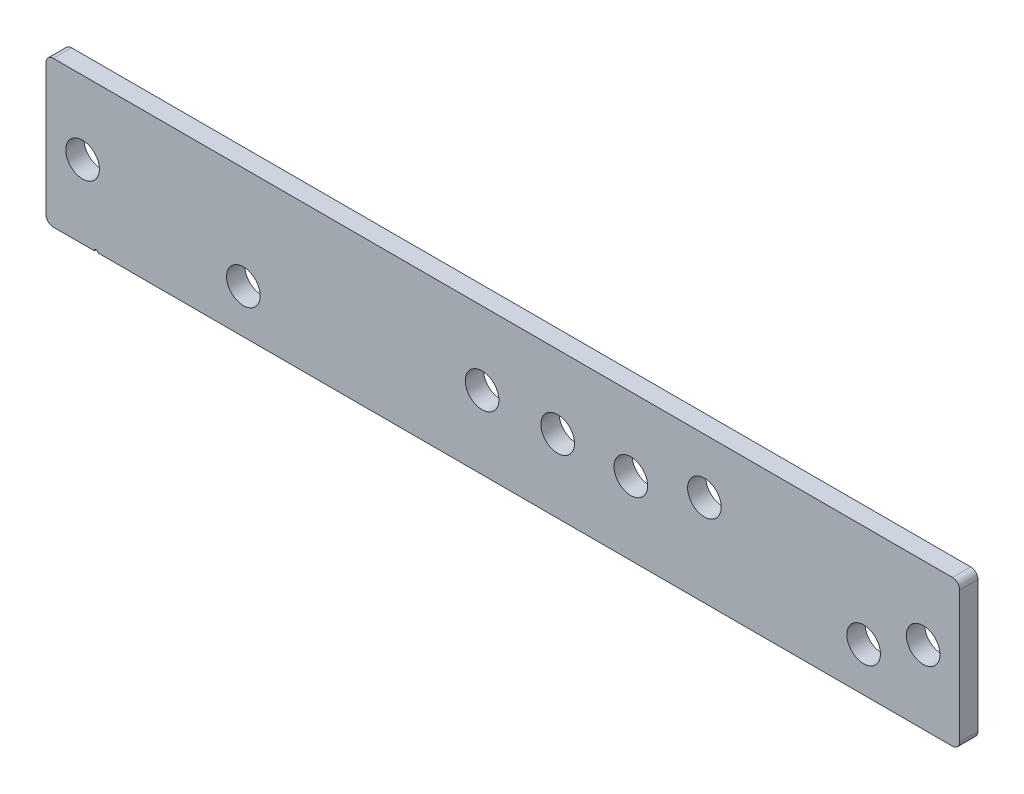
ISO-10303-21;
HEADER;
FILE_DESCRIPTION(('STEP AP214'),'2;1');
FILE_NAME('part.step','',(''),(''),'','','');
FILE_SCHEMA(('AUTOMOTIVE_DESIGN { 1 0 10303 214 1 1 1 1 }'));
ENDSEC;
DATA;
#1=APPLICATION_CONTEXT('core data for automotive mechanical design processes');
#2=APPLICATION_PROTOCOL_DEFINITION('international standard','automotive_design',2000,#1);
#3=PRODUCT_CONTEXT('',#1,'mechanical');
#4=PRODUCT('Part','Part','',(#3));
#5=PRODUCT_RELATED_PRODUCT_CATEGORY('part','',(#4));
#6=PRODUCT_DEFINITION_FORMATION('','',#4);
#7=PRODUCT_DEFINITION_CONTEXT('part definition',#1,'design');
#8=PRODUCT_DEFINITION('design','',#6,#7);
#9=PRODUCT_DEFINITION_SHAPE('','',#8);
#10=(LENGTH_UNIT() NAMED_UNIT(*) SI_UNIT(.MILLI.,.METRE.));
#11=(NAMED_UNIT(*) PLANE_ANGLE_UNIT() SI_UNIT($,.RADIAN.));
#12=(NAMED_UNIT(*) SI_UNIT($,.STERADIAN.) SOLID_ANGLE_UNIT());
#13=UNCERTAINTY_MEASURE_WITH_UNIT(LENGTH_MEASURE(1.E-05),#10,'distance_accuracy_value','');
#14=(GEOMETRIC_REPRESENTATION_CONTEXT(3) GLOBAL_UNCERTAINTY_ASSIGNED_CONTEXT((#13)) GLOBAL_UNIT_ASSIGNED_CONTEXT((#10,
#11,#12)) REPRESENTATION_CONTEXT('',''));
#15=CARTESIAN_POINT('',(0.,0.,0.));
#16=DIRECTION('',(0.,0.,1.));
#17=DIRECTION('',(1.,0.,0.));
#18=AXIS2_PLACEMENT_3D('',#15,#16,#17);
#19=CARTESIAN_POINT('',(-125.,-20.,5.));
#20=DIRECTION('',(0.,1.,0.));
#21=DIRECTION('',(-1.,0.,0.));
#22=AXIS2_PLACEMENT_3D('',#19,#20,#21);
#23=PLANE('',#22);
#24=DIRECTION('',(1.,0.,0.));
#25=VECTOR('',#24,1.);
#26=CARTESIAN_POINT('',(-125.,-20.,5.));
#27=LINE('',#26,#25);
#28=CARTESIAN_POINT('',(-123.,-20.,5.));
#29=VERTEX_POINT('',#28);
#30=CARTESIAN_POINT('',(-111.784271247392,-20.,5.));
#31=VERTEX_POINT('',#30);
#32=EDGE_CURVE('E95',#29,#31,#27,.T.);
#33=ORIENTED_EDGE('',*,*,#32,.F.);
#34=DIRECTION('',(0.,0.,-1.));
#35=VECTOR('',#34,1.);
#36=CARTESIAN_POINT('',(-123.,-20.,5.));
#37=LINE('',#36,#35);
#38=CARTESIAN_POINT('',(-123.,-20.,0.));
#39=VERTEX_POINT('',#38);
#40=EDGE_CURVE('E153',#29,#39,#37,.T.);
#41=ORIENTED_EDGE('',*,*,#40,.T.);
#42=DIRECTION('',(1.,0.,0.));
#43=VECTOR('',#42,1.);
#44=CARTESIAN_POINT('',(-125.,-20.,0.));
#45=LINE('',#44,#43);
#46=CARTESIAN_POINT('',(-111.784271247392,-20.,0.));
#47=VERTEX_POINT('',#46);
#48=EDGE_CURVE('E122',#39,#47,#45,.T.);
#49=ORIENTED_EDGE('',*,*,#48,.T.);
#50=DIRECTION('',(0.,0.,1.));
#51=VECTOR('',#50,1.);
#52=CARTESIAN_POINT('',(-111.784271247392,-20.,-13.0107647738325));
#53=LINE('',#52,#51);
#54=EDGE_CURVE('E115',#47,#31,#53,.T.);
#55=ORIENTED_EDGE('',*,*,#54,.T.);
#56=EDGE_LOOP('',(#33,#41,#49,#55));
#57=FACE_BOUND('',#56,.T.);
#58=ADVANCED_FACE('F16',(#57),#23,.F.);
#59=CARTESIAN_POINT('',(-125.,20.,5.));
#60=DIRECTION('',(1.,0.,0.));
#61=DIRECTION('',(0.,1.,0.));
#62=AXIS2_PLACEMENT_3D('',#59,#60,#61);
#63=PLANE('',#62);
#64=DIRECTION('',(0.,-1.,0.));
#65=VECTOR('',#64,1.);
#66=CARTESIAN_POINT('',(-125.,20.,0.));
#67=LINE('',#66,#65);
#68=CARTESIAN_POINT('',(-125.,18.,0.));
#69=VERTEX_POINT('',#68);
#70=CARTESIAN_POINT('',(-125.,-18.,0.));
#71=VERTEX_POINT('',#70);
#72=EDGE_CURVE('E146',#69,#71,#67,.T.);
#73=ORIENTED_EDGE('',*,*,#72,.T.);
#74=DIRECTION('',(0.,0.,-1.));
#75=VECTOR('',#74,1.);
#76=CARTESIAN_POINT('',(-125.,-18.,5.));
#77=LINE('',#76,#75);
#78=CARTESIAN_POINT('',(-125.,-18.,5.));
#79=VERTEX_POINT('',#78);
#80=EDGE_CURVE('E174',#71,#79,#77,.F.);
#81=ORIENTED_EDGE('',*,*,#80,.T.);
#82=DIRECTION('',(0.,-1.,0.));
#83=VECTOR('',#82,1.);
#84=CARTESIAN_POINT('',(-125.,20.,5.));
#85=LINE('',#84,#83);
#86=CARTESIAN_POINT('',(-125.,18.,5.));
#87=VERTEX_POINT('',#86);
#88=EDGE_CURVE('E147',#87,#79,#85,.T.);
#89=ORIENTED_EDGE('',*,*,#88,.F.);
#90=DIRECTION('',(0.,0.,-1.));
#91=VECTOR('',#90,1.);
#92=CARTESIAN_POINT('',(-125.,18.,5.));
#93=LINE('',#92,#91);
#94=EDGE_CURVE('E171',#87,#69,#93,.T.);
#95=ORIENTED_EDGE('',*,*,#94,.T.);
#96=EDGE_LOOP('',(#73,#81,#89,#95));
#97=FACE_BOUND('',#96,.T.);
#98=ADVANCED_FACE('F243',(#97),#63,.F.);
#99=CARTESIAN_POINT('',(-110.784271247392,-20.,0.));
#100=VERTEX_POINT('',#99);
#101=CARTESIAN_POINT('',(123.,-19.9999999999999,0.));
#102=VERTEX_POINT('',#101);
#103=EDGE_CURVE('E156',#100,#102,#45,.T.);
#104=ORIENTED_EDGE('',*,*,#103,.T.);
#105=DIRECTION('',(0.,0.,-1.));
#106=VECTOR('',#105,1.);
#107=CARTESIAN_POINT('',(123.,-19.9999999999999,5.));
#108=LINE('',#107,#106);
#109=CARTESIAN_POINT('',(123.,-19.9999999999999,5.));
#110=VERTEX_POINT('',#109);
#111=EDGE_CURVE('E10',#102,#110,#108,.F.);
#112=ORIENTED_EDGE('',*,*,#111,.T.);
#113=CARTESIAN_POINT('',(-110.784271247392,-20.,5.));
#114=VERTEX_POINT('',#113);
#115=EDGE_CURVE('E110',#114,#110,#27,.T.);
#116=ORIENTED_EDGE('',*,*,#115,.F.);
#117=DIRECTION('',(0.,0.,1.));
#118=VECTOR('',#117,1.);
#119=CARTESIAN_POINT('',(-110.784271247392,-20.,-13.0107647738325));
#120=LINE('',#119,#118);
#121=EDGE_CURVE('E118',#100,#114,#120,.T.);
#122=ORIENTED_EDGE('',*,*,#121,.F.);
#123=EDGE_LOOP('',(#104,#112,#116,#122));
#124=FACE_BOUND('',#123,.T.);
#125=ADVANCED_FACE('F220',(#124),#23,.F.);
#126=CARTESIAN_POINT('',(125.,20.,5.));
#127=DIRECTION('',(-1.,0.,0.));
#128=DIRECTION('',(0.,0.,1.));
#129=AXIS2_PLACEMENT_3D('',#126,#127,#128);
#130=PLANE('',#129);
#131=DIRECTION('',(0.,1.,0.));
#132=VECTOR('',#131,1.);
#133=CARTESIAN_POINT('',(125.,20.,5.));
#134=LINE('',#133,#132);
#135=CARTESIAN_POINT('',(125.,-17.9999999999999,5.));
#136=VERTEX_POINT('',#135);
#137=CARTESIAN_POINT('',(125.,18.,5.));
#138=VERTEX_POINT('',#137);
#139=EDGE_CURVE('E109',#136,#138,#134,.T.);
#140=ORIENTED_EDGE('',*,*,#139,.F.);
#141=DIRECTION('',(0.,0.,-1.));
#142=VECTOR('',#141,1.);
#143=CARTESIAN_POINT('',(125.,-17.9999999999999,5.));
#144=LINE('',#143,#142);
#145=CARTESIAN_POINT('',(125.,-17.9999999999999,0.));
#146=VERTEX_POINT('',#145);
#147=EDGE_CURVE('E25',#136,#146,#144,.T.);
#148=ORIENTED_EDGE('',*,*,#147,.T.);
#149=DIRECTION('',(0.,1.,0.));
#150=VECTOR('',#149,1.);
#151=CARTESIAN_POINT('',(125.,20.,0.));
#152=LINE('',#151,#150);
#153=CARTESIAN_POINT('',(125.,18.,0.));
#154=VERTEX_POINT('',#153);
#155=EDGE_CURVE('E158',#146,#154,#152,.T.);
#156=ORIENTED_EDGE('',*,*,#155,.T.);
#157=DIRECTION('',(0.,0.,-1.));
#158=VECTOR('',#157,1.);
#159=CARTESIAN_POINT('',(125.,18.,5.));
#160=LINE('',#159,#158);
#161=EDGE_CURVE('E186',#154,#138,#160,.F.);
#162=ORIENTED_EDGE('',*,*,#161,.T.);
#163=EDGE_LOOP('',(#140,#148,#156,#162));
#164=FACE_BOUND('',#163,.T.);
#165=ADVANCED_FACE('F230',(#164),#130,.F.);
#166=CARTESIAN_POINT('',(-125.,20.,5.));
#167=DIRECTION('',(0.,-1.,0.));
#168=DIRECTION('',(0.,0.,-1.));
#169=AXIS2_PLACEMENT_3D('',#166,#167,#168);
#170=PLANE('',#169);
#171=DIRECTION('',(-1.,0.,0.));
#172=VECTOR('',#171,1.);
#173=CARTESIAN_POINT('',(-125.,20.,0.));
#174=LINE('',#173,#172);
#175=CARTESIAN_POINT('',(123.,20.,0.));
#176=VERTEX_POINT('',#175);
#177=CARTESIAN_POINT('',(-123.,20.,0.));
#178=VERTEX_POINT('',#177);
#179=EDGE_CURVE('E148',#176,#178,#174,.T.);
#180=ORIENTED_EDGE('',*,*,#179,.T.);
#181=DIRECTION('',(0.,0.,-1.));
#182=VECTOR('',#181,1.);
#183=CARTESIAN_POINT('',(-123.,20.,5.));
#184=LINE('',#183,#182);
#185=CARTESIAN_POINT('',(-123.,20.,5.));
#186=VERTEX_POINT('',#185);
#187=EDGE_CURVE('E33',#178,#186,#184,.F.);
#188=ORIENTED_EDGE('',*,*,#187,.T.);
#189=DIRECTION('',(-1.,0.,0.));
#190=VECTOR('',#189,1.);
#191=CARTESIAN_POINT('',(-125.,20.,5.));
#192=LINE('',#191,#190);
#193=CARTESIAN_POINT('',(123.,20.,5.));
#194=VERTEX_POINT('',#193);
#195=EDGE_CURVE('E151',#194,#186,#192,.T.);
#196=ORIENTED_EDGE('',*,*,#195,.F.);
#197=DIRECTION('',(0.,0.,-1.));
#198=VECTOR('',#197,1.);
#199=CARTESIAN_POINT('',(123.,20.,5.));
#200=LINE('',#199,#198);
#201=EDGE_CURVE('E182',#194,#176,#200,.T.);
#202=ORIENTED_EDGE('',*,*,#201,.T.);
#203=EDGE_LOOP('',(#180,#188,#196,#202));
#204=FACE_BOUND('',#203,.T.);
#205=ADVANCED_FACE('F235',(#204),#170,.F.);
#206=CARTESIAN_POINT('',(0.,0.,5.));
#207=DIRECTION('',(0.,0.,1.));
#208=DIRECTION('',(1.,0.,0.));
#209=AXIS2_PLACEMENT_3D('',#206,#207,#208);
#210=PLANE('',#209);
#211=CARTESIAN_POINT('',(15.,0.,5.));
#212=DIRECTION('',(0.,0.,1.));
#213=DIRECTION('',(1.,0.,0.));
#214=AXIS2_PLACEMENT_3D('',#211,#212,#213);
#215=CIRCLE('',#214,4.6);
#216=CARTESIAN_POINT('',(19.6,0.,5.));
#217=VERTEX_POINT('',#216);
#218=EDGE_CURVE('E196',#217,#217,#215,.T.);
#219=ORIENTED_EDGE('',*,*,#218,.F.);
#220=EDGE_LOOP('',(#219));
#221=FACE_BOUND('',#220,.T.);
#222=CARTESIAN_POINT('',(35.,0.,5.));
#223=DIRECTION('',(0.,0.,1.));
#224=DIRECTION('',(1.,0.,0.));
#225=AXIS2_PLACEMENT_3D('',#222,#223,#224);
#226=CIRCLE('',#225,4.6);
#227=CARTESIAN_POINT('',(39.6,0.,5.));
#228=VERTEX_POINT('',#227);
#229=EDGE_CURVE('E312',#228,#228,#226,.T.);
#230=ORIENTED_EDGE('',*,*,#229,.F.);
#231=EDGE_LOOP('',(#230));
#232=FACE_BOUND('',#231,.T.);
#233=CARTESIAN_POINT('',(115.,0.,5.));
#234=DIRECTION('',(0.,0.,1.));
#235=DIRECTION('',(1.,0.,0.));
#236=AXIS2_PLACEMENT_3D('',#233,#234,#235);
#237=CIRCLE('',#236,4.60000000000001);
#238=CARTESIAN_POINT('',(119.6,0.,5.));
#239=VERTEX_POINT('',#238);
#240=EDGE_CURVE('E209',#239,#239,#237,.T.);
#241=ORIENTED_EDGE('',*,*,#240,.F.);
#242=EDGE_LOOP('',(#241));
#243=FACE_BOUND('',#242,.T.);
#244=CARTESIAN_POINT('',(-115.,0.,5.));
#245=DIRECTION('',(0.,0.,1.));
#246=DIRECTION('',(1.,0.,0.));
#247=AXIS2_PLACEMENT_3D('',#244,#245,#246);
#248=CIRCLE('',#247,4.6);
#249=CARTESIAN_POINT('',(-110.4,0.,5.));
#250=VERTEX_POINT('',#249);
#251=EDGE_CURVE('E192',#250,#250,#248,.T.);
#252=ORIENTED_EDGE('',*,*,#251,.F.);
#253=EDGE_LOOP('',(#252));
#254=FACE_BOUND('',#253,.T.);
#255=ORIENTED_EDGE('',*,*,#88,.T.);
#256=CARTESIAN_POINT('',(-123.,-18.,5.));
#257=DIRECTION('',(0.,0.,1.));
#258=DIRECTION('',(1.,0.,0.));
#259=AXIS2_PLACEMENT_3D('',#256,#257,#258);
#260=CIRCLE('',#259,2.);
#261=EDGE_CURVE('E104',#79,#29,#260,.T.);
#262=ORIENTED_EDGE('',*,*,#261,.T.);
#263=ORIENTED_EDGE('',*,*,#32,.T.);
#264=CARTESIAN_POINT('',(-111.284271247392,-20.,5.));
#265=DIRECTION('',(0.,0.,1.));
#266=DIRECTION('',(-1.,0.,0.));
#267=AXIS2_PLACEMENT_3D('',#264,#265,#266);
#268=CIRCLE('',#267,0.5);
#269=EDGE_CURVE('E101',#114,#31,#268,.T.);
#270=ORIENTED_EDGE('',*,*,#269,.F.);
#271=ORIENTED_EDGE('',*,*,#115,.T.);
#272=CARTESIAN_POINT('',(123.,-17.9999999999999,5.));
#273=DIRECTION('',(0.,0.,1.));
#274=DIRECTION('',(1.,0.,0.));
#275=AXIS2_PLACEMENT_3D('',#272,#273,#274);
#276=CIRCLE('',#275,2.);
#277=EDGE_CURVE('E177',#110,#136,#276,.T.);
#278=ORIENTED_EDGE('',*,*,#277,.T.);
#279=ORIENTED_EDGE('',*,*,#139,.T.);
#280=CARTESIAN_POINT('',(123.,18.,5.));
#281=DIRECTION('',(0.,0.,1.));
#282=DIRECTION('',(1.,0.,0.));
#283=AXIS2_PLACEMENT_3D('',#280,#281,#282);
#284=CIRCLE('',#283,2.);
#285=EDGE_CURVE('E40',#138,#194,#284,.T.);
#286=ORIENTED_EDGE('',*,*,#285,.T.);
#287=ORIENTED_EDGE('',*,*,#195,.T.);
#288=CARTESIAN_POINT('',(-123.,18.,5.));
#289=DIRECTION('',(0.,0.,1.));
#290=DIRECTION('',(1.,0.,0.));
#291=AXIS2_PLACEMENT_3D('',#288,#289,#290);
#292=CIRCLE('',#291,2.);
#293=EDGE_CURVE('E179',#186,#87,#292,.T.);
#294=ORIENTED_EDGE('',*,*,#293,.T.);
#295=EDGE_LOOP('',(#255,#262,#263,#270,#271,#278,#279,#286,#287,#294));
#296=FACE_BOUND('',#295,.T.);
#297=CARTESIAN_POINT('',(55.1370849899175,4.99999999999998,5.));
#298=DIRECTION('',(0.,0.,1.));
#299=DIRECTION('',(1.,0.,0.));
#300=AXIS2_PLACEMENT_3D('',#297,#298,#299);
#301=CIRCLE('',#300,4.6);
#302=CARTESIAN_POINT('',(59.7370849899175,4.99999999999998,5.));
#303=VERTEX_POINT('',#302);
#304=EDGE_CURVE('E211',#303,#303,#301,.T.);
#305=ORIENTED_EDGE('',*,*,#304,.F.);
#306=EDGE_LOOP('',(#305));
#307=FACE_BOUND('',#306,.T.);
#308=CARTESIAN_POINT('',(98.7056274848413,-8.00000000000002,5.));
#309=DIRECTION('',(0.,0.,1.));
#310=DIRECTION('',(1.,0.,0.));
#311=AXIS2_PLACEMENT_3D('',#308,#309,#310);
#312=CIRCLE('',#311,4.60000000000001);
#313=CARTESIAN_POINT('',(103.305627484841,-8.00000000000002,5.));
#314=VERTEX_POINT('',#313);
#315=EDGE_CURVE('E135',#314,#314,#312,.T.);
#316=ORIENTED_EDGE('',*,*,#315,.F.);
#317=EDGE_LOOP('',(#316));
#318=FACE_BOUND('',#317,.T.);
#319=CARTESIAN_POINT('',(-5.68801404862909,0.,5.));
#320=DIRECTION('',(0.,0.,1.));
#321=DIRECTION('',(1.,0.,0.));
#322=AXIS2_PLACEMENT_3D('',#319,#320,#321);
#323=CIRCLE('',#322,4.6);
#324=CARTESIAN_POINT('',(-1.08801404862909,0.,5.));
#325=VERTEX_POINT('',#324);
#326=EDGE_CURVE('E127',#325,#325,#323,.T.);
#327=ORIENTED_EDGE('',*,*,#326,.F.);
#328=EDGE_LOOP('',(#327));
#329=FACE_BOUND('',#328,.T.);
#330=CARTESIAN_POINT('',(-70.99999999993,-8.00000000000002,5.));
#331=DIRECTION('',(0.,0.,1.));
#332=DIRECTION('',(1.,0.,0.));
#333=AXIS2_PLACEMENT_3D('',#330,#331,#332);
#334=CIRCLE('',#333,4.6);
#335=CARTESIAN_POINT('',(-66.39999999993,-8.00000000000002,5.));
#336=VERTEX_POINT('',#335);
#337=EDGE_CURVE('E134',#336,#336,#334,.T.);
#338=ORIENTED_EDGE('',*,*,#337,.F.);
#339=EDGE_LOOP('',(#338));
#340=FACE_BOUND('',#339,.T.);
#341=ADVANCED_FACE('F98',(#221,#232,#243,#254,#296,#307,#318,#329,#340),#210,.T.);
#342=CARTESIAN_POINT('',(0.,0.,0.));
#343=DIRECTION('',(0.,0.,1.));
#344=DIRECTION('',(1.,0.,0.));
#345=AXIS2_PLACEMENT_3D('',#342,#343,#344);
#346=PLANE('',#345);
#347=CARTESIAN_POINT('',(15.,0.,0.));
#348=DIRECTION('',(0.,0.,1.));
#349=DIRECTION('',(1.,0.,0.));
#350=AXIS2_PLACEMENT_3D('',#347,#348,#349);
#351=CIRCLE('',#350,4.6);
#352=CARTESIAN_POINT('',(19.6,0.,0.));
#353=VERTEX_POINT('',#352);
#354=EDGE_CURVE('E20',#353,#353,#351,.T.);
#355=ORIENTED_EDGE('',*,*,#354,.T.);
#356=EDGE_LOOP('',(#355));
#357=FACE_BOUND('',#356,.T.);
#358=CARTESIAN_POINT('',(35.,0.,0.));
#359=DIRECTION('',(0.,0.,1.));
#360=DIRECTION('',(1.,0.,0.));
#361=AXIS2_PLACEMENT_3D('',#358,#359,#360);
#362=CIRCLE('',#361,4.6);
#363=CARTESIAN_POINT('',(39.6,0.,0.));
#364=VERTEX_POINT('',#363);
#365=EDGE_CURVE('E195',#364,#364,#362,.T.);
#366=ORIENTED_EDGE('',*,*,#365,.T.);
#367=EDGE_LOOP('',(#366));
#368=FACE_BOUND('',#367,.T.);
#369=CARTESIAN_POINT('',(115.,0.,0.));
#370=DIRECTION('',(0.,0.,1.));
#371=DIRECTION('',(1.,0.,0.));
#372=AXIS2_PLACEMENT_3D('',#369,#370,#371);
#373=CIRCLE('',#372,4.60000000000001);
#374=CARTESIAN_POINT('',(119.6,0.,0.));
#375=VERTEX_POINT('',#374);
#376=EDGE_CURVE('E193',#375,#375,#373,.T.);
#377=ORIENTED_EDGE('',*,*,#376,.T.);
#378=EDGE_LOOP('',(#377));
#379=FACE_BOUND('',#378,.T.);
#380=CARTESIAN_POINT('',(-115.,0.,0.));
#381=DIRECTION('',(0.,0.,1.));
#382=DIRECTION('',(1.,0.,0.));
#383=AXIS2_PLACEMENT_3D('',#380,#381,#382);
#384=CIRCLE('',#383,4.6);
#385=CARTESIAN_POINT('',(-110.4,0.,0.));
#386=VERTEX_POINT('',#385);
#387=EDGE_CURVE('E119',#386,#386,#384,.T.);
#388=ORIENTED_EDGE('',*,*,#387,.T.);
#389=EDGE_LOOP('',(#388));
#390=FACE_BOUND('',#389,.T.);
#391=CARTESIAN_POINT('',(55.1370849899175,4.99999999999998,0.));
#392=DIRECTION('',(0.,0.,1.));
#393=DIRECTION('',(1.,0.,0.));
#394=AXIS2_PLACEMENT_3D('',#391,#392,#393);
#395=CIRCLE('',#394,4.6);
#396=CARTESIAN_POINT('',(59.7370849899175,4.99999999999998,0.));
#397=VERTEX_POINT('',#396);
#398=EDGE_CURVE('E138',#397,#397,#395,.F.);
#399=ORIENTED_EDGE('',*,*,#398,.F.);
#400=EDGE_LOOP('',(#399));
#401=FACE_BOUND('',#400,.T.);
#402=CARTESIAN_POINT('',(98.7056274848413,-8.00000000000002,0.));
#403=DIRECTION('',(0.,0.,1.));
#404=DIRECTION('',(1.,0.,0.));
#405=AXIS2_PLACEMENT_3D('',#402,#403,#404);
#406=CIRCLE('',#405,4.60000000000001);
#407=CARTESIAN_POINT('',(103.305627484841,-8.00000000000002,0.));
#408=VERTEX_POINT('',#407);
#409=EDGE_CURVE('E131',#408,#408,#406,.F.);
#410=ORIENTED_EDGE('',*,*,#409,.F.);
#411=EDGE_LOOP('',(#410));
#412=FACE_BOUND('',#411,.T.);
#413=CARTESIAN_POINT('',(-5.68801404862909,0.,0.));
#414=DIRECTION('',(0.,0.,1.));
#415=DIRECTION('',(1.,0.,0.));
#416=AXIS2_PLACEMENT_3D('',#413,#414,#415);
#417=CIRCLE('',#416,4.6);
#418=CARTESIAN_POINT('',(-1.08801404862909,0.,0.));
#419=VERTEX_POINT('',#418);
#420=EDGE_CURVE('E130',#419,#419,#417,.F.);
#421=ORIENTED_EDGE('',*,*,#420,.F.);
#422=EDGE_LOOP('',(#421));
#423=FACE_BOUND('',#422,.T.);
#424=CARTESIAN_POINT('',(-70.99999999993,-8.00000000000002,0.));
#425=DIRECTION('',(0.,0.,1.));
#426=DIRECTION('',(1.,0.,0.));
#427=AXIS2_PLACEMENT_3D('',#424,#425,#426);
#428=CIRCLE('',#427,4.6);
#429=CARTESIAN_POINT('',(-66.39999999993,-8.00000000000002,0.));
#430=VERTEX_POINT('',#429);
#431=EDGE_CURVE('E143',#430,#430,#428,.F.);
#432=ORIENTED_EDGE('',*,*,#431,.F.);
#433=EDGE_LOOP('',(#432));
#434=FACE_BOUND('',#433,.T.);
#435=ORIENTED_EDGE('',*,*,#48,.F.);
#436=CARTESIAN_POINT('',(-123.,-18.,0.));
#437=DIRECTION('',(0.,0.,1.));
#438=DIRECTION('',(1.,0.,0.));
#439=AXIS2_PLACEMENT_3D('',#436,#437,#438);
#440=CIRCLE('',#439,2.);
#441=EDGE_CURVE('E169',#39,#71,#440,.F.);
#442=ORIENTED_EDGE('',*,*,#441,.T.);
#443=ORIENTED_EDGE('',*,*,#72,.F.);
#444=CARTESIAN_POINT('',(-123.,18.,0.));
#445=DIRECTION('',(0.,0.,1.));
#446=DIRECTION('',(1.,0.,0.));
#447=AXIS2_PLACEMENT_3D('',#444,#445,#446);
#448=CIRCLE('',#447,2.);
#449=EDGE_CURVE('E167',#69,#178,#448,.F.);
#450=ORIENTED_EDGE('',*,*,#449,.T.);
#451=ORIENTED_EDGE('',*,*,#179,.F.);
#452=CARTESIAN_POINT('',(123.,18.,0.));
#453=DIRECTION('',(0.,0.,1.));
#454=DIRECTION('',(1.,0.,0.));
#455=AXIS2_PLACEMENT_3D('',#452,#453,#454);
#456=CIRCLE('',#455,2.);
#457=EDGE_CURVE('E163',#176,#154,#456,.F.);
#458=ORIENTED_EDGE('',*,*,#457,.T.);
#459=ORIENTED_EDGE('',*,*,#155,.F.);
#460=CARTESIAN_POINT('',(123.,-17.9999999999999,0.));
#461=DIRECTION('',(0.,0.,1.));
#462=DIRECTION('',(1.,0.,0.));
#463=AXIS2_PLACEMENT_3D('',#460,#461,#462);
#464=CIRCLE('',#463,2.);
#465=EDGE_CURVE('E165',#146,#102,#464,.F.);
#466=ORIENTED_EDGE('',*,*,#465,.T.);
#467=ORIENTED_EDGE('',*,*,#103,.F.);
#468=CARTESIAN_POINT('',(-111.284271247392,-20.,0.));
#469=DIRECTION('',(0.,0.,1.));
#470=DIRECTION('',(1.,0.,0.));
#471=AXIS2_PLACEMENT_3D('',#468,#469,#470);
#472=CIRCLE('',#471,0.5);
#473=EDGE_CURVE('E124',#47,#100,#472,.F.);
#474=ORIENTED_EDGE('',*,*,#473,.F.);
#475=EDGE_LOOP('',(#435,#442,#443,#450,#451,#458,#459,#466,#467,#474));
#476=FACE_BOUND('',#475,.T.);
#477=ADVANCED_FACE('F222',(#357,#368,#379,#390,#401,#412,#423,#434,#476),#346,.F.);
#478=CARTESIAN_POINT('',(-70.99999999993,-8.00000000000002,-13.0107647738325));
#479=DIRECTION('',(0.,0.,1.));
#480=DIRECTION('',(1.,0.,0.));
#481=AXIS2_PLACEMENT_3D('',#478,#479,#480);
#482=CYLINDRICAL_SURFACE('',#481,4.6);
#483=ORIENTED_EDGE('',*,*,#431,.T.);
#484=EDGE_LOOP('',(#483));
#485=FACE_BOUND('',#484,.T.);
#486=ORIENTED_EDGE('',*,*,#337,.T.);
#487=EDGE_LOOP('',(#486));
#488=FACE_BOUND('',#487,.T.);
#489=ADVANCED_FACE('F275',(#485,#488),#482,.F.);
#490=CARTESIAN_POINT('',(-5.68801404862909,0.,-13.0107647738325));
#491=DIRECTION('',(0.,0.,1.));
#492=DIRECTION('',(1.,0.,0.));
#493=AXIS2_PLACEMENT_3D('',#490,#491,#492);
#494=CYLINDRICAL_SURFACE('',#493,4.6);
#495=ORIENTED_EDGE('',*,*,#420,.T.);
#496=EDGE_LOOP('',(#495));
#497=FACE_BOUND('',#496,.T.);
#498=ORIENTED_EDGE('',*,*,#326,.T.);
#499=EDGE_LOOP('',(#498));
#500=FACE_BOUND('',#499,.T.);
#501=ADVANCED_FACE('F281',(#497,#500),#494,.F.);
#502=CARTESIAN_POINT('',(98.7056274848413,-8.00000000000002,-13.0107647738325));
#503=DIRECTION('',(0.,0.,1.));
#504=DIRECTION('',(1.,0.,0.));
#505=AXIS2_PLACEMENT_3D('',#502,#503,#504);
#506=CYLINDRICAL_SURFACE('',#505,4.60000000000001);
#507=ORIENTED_EDGE('',*,*,#409,.T.);
#508=EDGE_LOOP('',(#507));
#509=FACE_BOUND('',#508,.T.);
#510=ORIENTED_EDGE('',*,*,#315,.T.);
#511=EDGE_LOOP('',(#510));
#512=FACE_BOUND('',#511,.T.);
#513=ADVANCED_FACE('F283',(#509,#512),#506,.F.);
#514=CARTESIAN_POINT('',(55.1370849899175,4.99999999999998,-13.0107647738325));
#515=DIRECTION('',(0.,0.,1.));
#516=DIRECTION('',(1.,0.,0.));
#517=AXIS2_PLACEMENT_3D('',#514,#515,#516);
#518=CYLINDRICAL_SURFACE('',#517,4.6);
#519=ORIENTED_EDGE('',*,*,#398,.T.);
#520=EDGE_LOOP('',(#519));
#521=FACE_BOUND('',#520,.T.);
#522=ORIENTED_EDGE('',*,*,#304,.T.);
#523=EDGE_LOOP('',(#522));
#524=FACE_BOUND('',#523,.T.);
#525=ADVANCED_FACE('F255',(#521,#524),#518,.F.);
#526=CARTESIAN_POINT('',(-111.284271247392,-20.,-13.0107647738325));
#527=DIRECTION('',(0.,0.,1.));
#528=DIRECTION('',(1.,0.,0.));
#529=AXIS2_PLACEMENT_3D('',#526,#527,#528);
#530=CYLINDRICAL_SURFACE('',#529,0.5);
#531=ORIENTED_EDGE('',*,*,#473,.T.);
#532=ORIENTED_EDGE('',*,*,#121,.T.);
#533=ORIENTED_EDGE('',*,*,#269,.T.);
#534=ORIENTED_EDGE('',*,*,#54,.F.);
#535=EDGE_LOOP('',(#531,#532,#533,#534));
#536=FACE_BOUND('',#535,.T.);
#537=ADVANCED_FACE('F114',(#536),#530,.F.);
#538=CARTESIAN_POINT('',(-123.,-18.,5.));
#539=DIRECTION('',(0.,0.,-1.));
#540=DIRECTION('',(-1.,0.,0.));
#541=AXIS2_PLACEMENT_3D('',#538,#539,#540);
#542=CYLINDRICAL_SURFACE('',#541,2.);
#543=ORIENTED_EDGE('',*,*,#261,.F.);
#544=ORIENTED_EDGE('',*,*,#80,.F.);
#545=ORIENTED_EDGE('',*,*,#441,.F.);
#546=ORIENTED_EDGE('',*,*,#40,.F.);
#547=EDGE_LOOP('',(#543,#544,#545,#546));
#548=FACE_BOUND('',#547,.T.);
#549=ADVANCED_FACE('F246',(#548),#542,.T.);
#550=CARTESIAN_POINT('',(-123.,18.,5.));
#551=DIRECTION('',(0.,0.,-1.));
#552=DIRECTION('',(-1.,0.,0.));
#553=AXIS2_PLACEMENT_3D('',#550,#551,#552);
#554=CYLINDRICAL_SURFACE('',#553,2.);
#555=ORIENTED_EDGE('',*,*,#293,.F.);
#556=ORIENTED_EDGE('',*,*,#187,.F.);
#557=ORIENTED_EDGE('',*,*,#449,.F.);
#558=ORIENTED_EDGE('',*,*,#94,.F.);
#559=EDGE_LOOP('',(#555,#556,#557,#558));
#560=FACE_BOUND('',#559,.T.);
#561=ADVANCED_FACE('F240',(#560),#554,.T.);
#562=CARTESIAN_POINT('',(123.,-17.9999999999999,5.));
#563=DIRECTION('',(0.,0.,-1.));
#564=DIRECTION('',(-1.,0.,0.));
#565=AXIS2_PLACEMENT_3D('',#562,#563,#564);
#566=CYLINDRICAL_SURFACE('',#565,2.);
#567=ORIENTED_EDGE('',*,*,#277,.F.);
#568=ORIENTED_EDGE('',*,*,#111,.F.);
#569=ORIENTED_EDGE('',*,*,#465,.F.);
#570=ORIENTED_EDGE('',*,*,#147,.F.);
#571=EDGE_LOOP('',(#567,#568,#569,#570));
#572=FACE_BOUND('',#571,.T.);
#573=ADVANCED_FACE('F227',(#572),#566,.T.);
#574=CARTESIAN_POINT('',(123.,18.,5.));
#575=DIRECTION('',(0.,0.,-1.));
#576=DIRECTION('',(-1.,0.,0.));
#577=AXIS2_PLACEMENT_3D('',#574,#575,#576);
#578=CYLINDRICAL_SURFACE('',#577,2.);
#579=ORIENTED_EDGE('',*,*,#285,.F.);
#580=ORIENTED_EDGE('',*,*,#161,.F.);
#581=ORIENTED_EDGE('',*,*,#457,.F.);
#582=ORIENTED_EDGE('',*,*,#201,.F.);
#583=EDGE_LOOP('',(#579,#580,#581,#582));
#584=FACE_BOUND('',#583,.T.);
#585=ADVANCED_FACE('F18',(#584),#578,.T.);
#586=CARTESIAN_POINT('',(-115.,0.,-5.));
#587=DIRECTION('',(0.,0.,1.));
#588=DIRECTION('',(1.,0.,0.));
#589=AXIS2_PLACEMENT_3D('',#586,#587,#588);
#590=CYLINDRICAL_SURFACE('',#589,4.6);
#591=ORIENTED_EDGE('',*,*,#251,.T.);
#592=EDGE_LOOP('',(#591));
#593=FACE_BOUND('',#592,.T.);
#594=ORIENTED_EDGE('',*,*,#387,.F.);
#595=EDGE_LOOP('',(#594));
#596=FACE_BOUND('',#595,.T.);
#597=ADVANCED_FACE('F293',(#593,#596),#590,.F.);
#598=CARTESIAN_POINT('',(115.,0.,-5.));
#599=DIRECTION('',(0.,0.,1.));
#600=DIRECTION('',(1.,0.,0.));
#601=AXIS2_PLACEMENT_3D('',#598,#599,#600);
#602=CYLINDRICAL_SURFACE('',#601,4.60000000000001);
#603=ORIENTED_EDGE('',*,*,#240,.T.);
#604=EDGE_LOOP('',(#603));
#605=FACE_BOUND('',#604,.T.);
#606=ORIENTED_EDGE('',*,*,#376,.F.);
#607=EDGE_LOOP('',(#606));
#608=FACE_BOUND('',#607,.T.);
#609=ADVANCED_FACE('F296',(#605,#608),#602,.F.);
#610=CARTESIAN_POINT('',(35.,0.,-5.));
#611=DIRECTION('',(0.,0.,1.));
#612=DIRECTION('',(1.,0.,0.));
#613=AXIS2_PLACEMENT_3D('',#610,#611,#612);
#614=CYLINDRICAL_SURFACE('',#613,4.6);
#615=ORIENTED_EDGE('',*,*,#229,.T.);
#616=EDGE_LOOP('',(#615));
#617=FACE_BOUND('',#616,.T.);
#618=ORIENTED_EDGE('',*,*,#365,.F.);
#619=EDGE_LOOP('',(#618));
#620=FACE_BOUND('',#619,.T.);
#621=ADVANCED_FACE('F299',(#617,#620),#614,.F.);
#622=CARTESIAN_POINT('',(15.,0.,-5.));
#623=DIRECTION('',(0.,0.,1.));
#624=DIRECTION('',(1.,0.,0.));
#625=AXIS2_PLACEMENT_3D('',#622,#623,#624);
#626=CYLINDRICAL_SURFACE('',#625,4.6);
#627=ORIENTED_EDGE('',*,*,#218,.T.);
#628=EDGE_LOOP('',(#627));
#629=FACE_BOUND('',#628,.T.);
#630=ORIENTED_EDGE('',*,*,#354,.F.);
#631=EDGE_LOOP('',(#630));
#632=FACE_BOUND('',#631,.T.);
#633=ADVANCED_FACE('F303',(#629,#632),#626,.F.);
#634=CLOSED_SHELL('',(#58,#98,#125,#165,#205,#341,#477,#489,#501,#513,#525,#537,#549,#561,#573,
#585,#597,#609,#621,#633));
#635=MANIFOLD_SOLID_BREP('B1',#634);
#636=ADVANCED_BREP_SHAPE_REPRESENTATION('',(#18,#635),#14);
#637=SHAPE_DEFINITION_REPRESENTATION(#9,#636);
ENDSEC;
END-ISO-10303-21;
